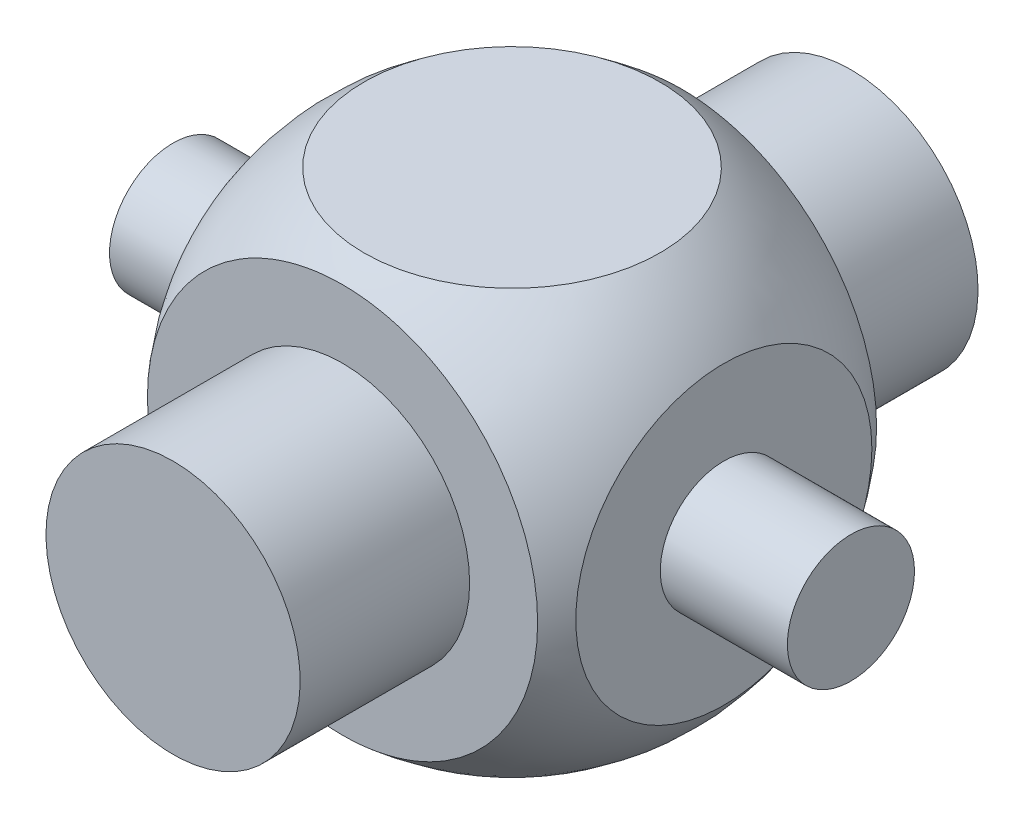
ISO-10303-21;
HEADER;
FILE_DESCRIPTION(('STEP AP214'),'2;1');
FILE_NAME('part.step','',(''),(''),'','','');
FILE_SCHEMA(('AUTOMOTIVE_DESIGN { 1 0 10303 214 1 1 1 1 }'));
ENDSEC;
DATA;
#1=APPLICATION_CONTEXT('core data for automotive mechanical design processes');
#2=APPLICATION_PROTOCOL_DEFINITION('international standard','automotive_design',2000,#1);
#3=PRODUCT_CONTEXT('',#1,'mechanical');
#4=PRODUCT('Part','Part','',(#3));
#5=PRODUCT_RELATED_PRODUCT_CATEGORY('part','',(#4));
#6=PRODUCT_DEFINITION_FORMATION('','',#4);
#7=PRODUCT_DEFINITION_CONTEXT('part definition',#1,'design');
#8=PRODUCT_DEFINITION('design','',#6,#7);
#9=PRODUCT_DEFINITION_SHAPE('','',#8);
#10=(LENGTH_UNIT() NAMED_UNIT(*) SI_UNIT(.MILLI.,.METRE.));
#11=(NAMED_UNIT(*) PLANE_ANGLE_UNIT() SI_UNIT($,.RADIAN.));
#12=(NAMED_UNIT(*) SI_UNIT($,.STERADIAN.) SOLID_ANGLE_UNIT());
#13=UNCERTAINTY_MEASURE_WITH_UNIT(LENGTH_MEASURE(1.E-05),#10,'distance_accuracy_value','');
#14=(GEOMETRIC_REPRESENTATION_CONTEXT(3) GLOBAL_UNCERTAINTY_ASSIGNED_CONTEXT((#13)) GLOBAL_UNIT_ASSIGNED_CONTEXT((#10,
#11,#12)) REPRESENTATION_CONTEXT('',''));
#15=CARTESIAN_POINT('',(0.,0.,0.));
#16=DIRECTION('',(0.,0.,1.));
#17=DIRECTION('',(1.,0.,0.));
#18=AXIS2_PLACEMENT_3D('',#15,#16,#17);
#19=CARTESIAN_POINT('',(0.,3.05,0.));
#20=DIRECTION('',(0.,-1.,0.));
#21=DIRECTION('',(0.,0.,1.));
#22=AXIS2_PLACEMENT_3D('',#19,#20,#21);
#23=SPHERICAL_SURFACE('',#22,3.05);
#24=CARTESIAN_POINT('',(-2.5,3.05,0.));
#25=DIRECTION('',(-1.,0.,0.));
#26=DIRECTION('',(0.,0.,1.));
#27=AXIS2_PLACEMENT_3D('',#24,#25,#26);
#28=CIRCLE('',#27,1.74714052096562);
#29=CARTESIAN_POINT('',(-2.5,3.05,1.74714052096562));
#30=VERTEX_POINT('',#29);
#31=EDGE_CURVE('E72',#30,#30,#28,.F.);
#32=ORIENTED_EDGE('',*,*,#31,.T.);
#33=EDGE_LOOP('',(#32));
#34=FACE_BOUND('',#33,.T.);
#35=CARTESIAN_POINT('',(0.,0.549999999999999,0.));
#36=DIRECTION('',(0.,-1.,0.));
#37=DIRECTION('',(0.,0.,-1.));
#38=AXIS2_PLACEMENT_3D('',#35,#36,#37);
#39=CIRCLE('',#38,1.74714052096561);
#40=CARTESIAN_POINT('',(0.,0.549999999999999,-1.74714052096561));
#41=VERTEX_POINT('',#40);
#42=EDGE_CURVE('E64',#41,#41,#39,.F.);
#43=ORIENTED_EDGE('',*,*,#42,.T.);
#44=EDGE_LOOP('',(#43));
#45=FACE_BOUND('',#44,.T.);
#46=CARTESIAN_POINT('',(0.,5.55,0.));
#47=DIRECTION('',(0.,1.,0.));
#48=DIRECTION('',(0.,0.,1.));
#49=AXIS2_PLACEMENT_3D('',#46,#47,#48);
#50=CIRCLE('',#49,1.74714052096562);
#51=CARTESIAN_POINT('',(0.,5.55,1.74714052096562));
#52=VERTEX_POINT('',#51);
#53=EDGE_CURVE('E71',#52,#52,#50,.F.);
#54=ORIENTED_EDGE('',*,*,#53,.T.);
#55=EDGE_LOOP('',(#54));
#56=FACE_BOUND('',#55,.T.);
#57=CARTESIAN_POINT('',(0.,3.05,2.));
#58=DIRECTION('',(0.,0.,1.));
#59=DIRECTION('',(0.,-1.,0.));
#60=AXIS2_PLACEMENT_3D('',#57,#58,#59);
#61=CIRCLE('',#60,2.30271578793389);
#62=CARTESIAN_POINT('',(0.,0.74728421206611,2.));
#63=VERTEX_POINT('',#62);
#64=EDGE_CURVE('E80',#63,#63,#61,.F.);
#65=ORIENTED_EDGE('',*,*,#64,.T.);
#66=EDGE_LOOP('',(#65));
#67=FACE_BOUND('',#66,.T.);
#68=CARTESIAN_POINT('',(0.,3.05,-2.));
#69=DIRECTION('',(0.,0.,-1.));
#70=DIRECTION('',(-1.,0.,0.));
#71=AXIS2_PLACEMENT_3D('',#68,#69,#70);
#72=CIRCLE('',#71,2.30271578793389);
#73=CARTESIAN_POINT('',(-2.30271578793389,3.05,-2.));
#74=VERTEX_POINT('',#73);
#75=EDGE_CURVE('E59',#74,#74,#72,.F.);
#76=ORIENTED_EDGE('',*,*,#75,.T.);
#77=EDGE_LOOP('',(#76));
#78=FACE_BOUND('',#77,.T.);
#79=CARTESIAN_POINT('',(2.5,3.05,0.));
#80=DIRECTION('',(1.,0.,0.));
#81=DIRECTION('',(0.,0.,-1.));
#82=AXIS2_PLACEMENT_3D('',#79,#80,#81);
#83=CIRCLE('',#82,1.74714052096561);
#84=CARTESIAN_POINT('',(2.5,3.05,-1.74714052096561));
#85=VERTEX_POINT('',#84);
#86=EDGE_CURVE('E67',#85,#85,#83,.F.);
#87=ORIENTED_EDGE('',*,*,#86,.T.);
#88=EDGE_LOOP('',(#87));
#89=FACE_BOUND('',#88,.T.);
#90=ADVANCED_FACE('F47',(#34,#45,#56,#67,#78,#89),#23,.T.);
#91=CARTESIAN_POINT('',(-3.05,5.55,2.));
#92=DIRECTION('',(0.,1.,0.));
#93=DIRECTION('',(0.,0.,1.));
#94=AXIS2_PLACEMENT_3D('',#91,#92,#93);
#95=PLANE('',#94);
#96=ORIENTED_EDGE('',*,*,#53,.F.);
#97=EDGE_LOOP('',(#96));
#98=FACE_BOUND('',#97,.T.);
#99=ADVANCED_FACE('F122',(#98),#95,.T.);
#100=CARTESIAN_POINT('',(-3.05,5.55,2.));
#101=DIRECTION('',(0.,0.,1.));
#102=DIRECTION('',(0.,-1.,0.));
#103=AXIS2_PLACEMENT_3D('',#100,#101,#102);
#104=PLANE('',#103);
#105=CARTESIAN_POINT('',(0.,3.05,2.));
#106=DIRECTION('',(0.,0.,1.));
#107=DIRECTION('',(0.,-1.,0.));
#108=AXIS2_PLACEMENT_3D('',#105,#106,#107);
#109=CIRCLE('',#108,1.5);
#110=CARTESIAN_POINT('',(0.,1.55,2.));
#111=VERTEX_POINT('',#110);
#112=EDGE_CURVE('E11',#111,#111,#109,.T.);
#113=ORIENTED_EDGE('',*,*,#112,.F.);
#114=EDGE_LOOP('',(#113));
#115=FACE_BOUND('',#114,.T.);
#116=ORIENTED_EDGE('',*,*,#64,.F.);
#117=EDGE_LOOP('',(#116));
#118=FACE_BOUND('',#117,.T.);
#119=ADVANCED_FACE('F129',(#115,#118),#104,.T.);
#120=CARTESIAN_POINT('',(-3.05,0.549999999999999,2.));
#121=DIRECTION('',(0.,-1.,0.));
#122=DIRECTION('',(0.,0.,-1.));
#123=AXIS2_PLACEMENT_3D('',#120,#121,#122);
#124=PLANE('',#123);
#125=ORIENTED_EDGE('',*,*,#42,.F.);
#126=EDGE_LOOP('',(#125));
#127=FACE_BOUND('',#126,.T.);
#128=ADVANCED_FACE('F161',(#127),#124,.T.);
#129=CARTESIAN_POINT('',(-3.05,5.55,-2.));
#130=DIRECTION('',(0.,0.,-1.));
#131=DIRECTION('',(-1.,0.,0.));
#132=AXIS2_PLACEMENT_3D('',#129,#130,#131);
#133=PLANE('',#132);
#134=CARTESIAN_POINT('',(0.,3.05,-2.));
#135=DIRECTION('',(0.,0.,-1.));
#136=DIRECTION('',(0.,1.,0.));
#137=AXIS2_PLACEMENT_3D('',#134,#135,#136);
#138=CIRCLE('',#137,1.5);
#139=CARTESIAN_POINT('',(0.,4.55,-2.));
#140=VERTEX_POINT('',#139);
#141=EDGE_CURVE('E99',#140,#140,#138,.T.);
#142=ORIENTED_EDGE('',*,*,#141,.F.);
#143=EDGE_LOOP('',(#142));
#144=FACE_BOUND('',#143,.T.);
#145=ORIENTED_EDGE('',*,*,#75,.F.);
#146=EDGE_LOOP('',(#145));
#147=FACE_BOUND('',#146,.T.);
#148=ADVANCED_FACE('F156',(#144,#147),#133,.T.);
#149=CARTESIAN_POINT('',(-2.5,0.55,-2.));
#150=DIRECTION('',(-1.,0.,0.));
#151=DIRECTION('',(0.,0.,1.));
#152=AXIS2_PLACEMENT_3D('',#149,#150,#151);
#153=PLANE('',#152);
#154=CARTESIAN_POINT('',(-2.5,3.05,0.));
#155=DIRECTION('',(-1.,0.,0.));
#156=DIRECTION('',(0.,0.,1.));
#157=AXIS2_PLACEMENT_3D('',#154,#155,#156);
#158=CIRCLE('',#157,0.75);
#159=CARTESIAN_POINT('',(-2.5,3.05,0.75));
#160=VERTEX_POINT('',#159);
#161=EDGE_CURVE('E54',#160,#160,#158,.T.);
#162=ORIENTED_EDGE('',*,*,#161,.F.);
#163=EDGE_LOOP('',(#162));
#164=FACE_BOUND('',#163,.T.);
#165=ORIENTED_EDGE('',*,*,#31,.F.);
#166=EDGE_LOOP('',(#165));
#167=FACE_BOUND('',#166,.T.);
#168=ADVANCED_FACE('F146',(#164,#167),#153,.T.);
#169=CARTESIAN_POINT('',(2.5,0.55,-2.));
#170=DIRECTION('',(1.,0.,0.));
#171=DIRECTION('',(0.,0.,-1.));
#172=AXIS2_PLACEMENT_3D('',#169,#170,#171);
#173=PLANE('',#172);
#174=CARTESIAN_POINT('',(2.5,3.05,0.));
#175=DIRECTION('',(1.,0.,0.));
#176=DIRECTION('',(0.,0.,-1.));
#177=AXIS2_PLACEMENT_3D('',#174,#175,#176);
#178=CIRCLE('',#177,0.75);
#179=CARTESIAN_POINT('',(2.5,3.05,-0.75));
#180=VERTEX_POINT('',#179);
#181=EDGE_CURVE('E87',#180,#180,#178,.T.);
#182=ORIENTED_EDGE('',*,*,#181,.F.);
#183=EDGE_LOOP('',(#182));
#184=FACE_BOUND('',#183,.T.);
#185=ORIENTED_EDGE('',*,*,#86,.F.);
#186=EDGE_LOOP('',(#185));
#187=FACE_BOUND('',#186,.T.);
#188=ADVANCED_FACE('F144',(#184,#187),#173,.T.);
#189=CARTESIAN_POINT('',(4.,3.05,0.));
#190=DIRECTION('',(-1.,0.,0.));
#191=DIRECTION('',(0.,0.,1.));
#192=AXIS2_PLACEMENT_3D('',#189,#190,#191);
#193=CYLINDRICAL_SURFACE('',#192,0.75);
#194=CARTESIAN_POINT('',(4.,3.05,0.));
#195=DIRECTION('',(1.,0.,0.));
#196=DIRECTION('',(0.,0.,-1.));
#197=AXIS2_PLACEMENT_3D('',#194,#195,#196);
#198=CIRCLE('',#197,0.75);
#199=CARTESIAN_POINT('',(4.,3.05,-0.75));
#200=VERTEX_POINT('',#199);
#201=EDGE_CURVE('E75',#200,#200,#198,.T.);
#202=ORIENTED_EDGE('',*,*,#201,.F.);
#203=EDGE_LOOP('',(#202));
#204=FACE_BOUND('',#203,.T.);
#205=ORIENTED_EDGE('',*,*,#181,.T.);
#206=EDGE_LOOP('',(#205));
#207=FACE_BOUND('',#206,.T.);
#208=ADVANCED_FACE('F145',(#204,#207),#193,.T.);
#209=CARTESIAN_POINT('',(4.,3.05,0.));
#210=DIRECTION('',(1.,0.,0.));
#211=DIRECTION('',(0.,0.,-1.));
#212=AXIS2_PLACEMENT_3D('',#209,#210,#211);
#213=PLANE('',#212);
#214=ORIENTED_EDGE('',*,*,#201,.T.);
#215=EDGE_LOOP('',(#214));
#216=FACE_BOUND('',#215,.T.);
#217=ADVANCED_FACE('F152',(#216),#213,.T.);
#218=CARTESIAN_POINT('',(-4.,3.05,0.));
#219=DIRECTION('',(1.,0.,0.));
#220=DIRECTION('',(0.,0.,-1.));
#221=AXIS2_PLACEMENT_3D('',#218,#219,#220);
#222=CYLINDRICAL_SURFACE('',#221,0.75);
#223=CARTESIAN_POINT('',(-4.,3.05,0.));
#224=DIRECTION('',(1.,0.,0.));
#225=DIRECTION('',(0.,0.,-1.));
#226=AXIS2_PLACEMENT_3D('',#223,#224,#225);
#227=CIRCLE('',#226,0.75);
#228=CARTESIAN_POINT('',(-4.,3.05,-0.75));
#229=VERTEX_POINT('',#228);
#230=EDGE_CURVE('E91',#229,#229,#227,.T.);
#231=ORIENTED_EDGE('',*,*,#230,.T.);
#232=EDGE_LOOP('',(#231));
#233=FACE_BOUND('',#232,.T.);
#234=ORIENTED_EDGE('',*,*,#161,.T.);
#235=EDGE_LOOP('',(#234));
#236=FACE_BOUND('',#235,.T.);
#237=ADVANCED_FACE('F184',(#233,#236),#222,.T.);
#238=CARTESIAN_POINT('',(-4.,3.05,0.));
#239=DIRECTION('',(-1.,0.,0.));
#240=DIRECTION('',(0.,0.,-1.));
#241=AXIS2_PLACEMENT_3D('',#238,#239,#240);
#242=PLANE('',#241);
#243=ORIENTED_EDGE('',*,*,#230,.F.);
#244=EDGE_LOOP('',(#243));
#245=FACE_BOUND('',#244,.T.);
#246=ADVANCED_FACE('F176',(#245),#242,.T.);
#247=CARTESIAN_POINT('',(0.,3.05,-4.));
#248=DIRECTION('',(0.,0.,1.));
#249=DIRECTION('',(0.,-1.,0.));
#250=AXIS2_PLACEMENT_3D('',#247,#248,#249);
#251=CYLINDRICAL_SURFACE('',#250,1.5);
#252=CARTESIAN_POINT('',(0.,3.05,-4.));
#253=DIRECTION('',(0.,0.,-1.));
#254=DIRECTION('',(0.,1.,0.));
#255=AXIS2_PLACEMENT_3D('',#252,#253,#254);
#256=CIRCLE('',#255,1.5);
#257=CARTESIAN_POINT('',(0.,4.55,-4.));
#258=VERTEX_POINT('',#257);
#259=EDGE_CURVE('E98',#258,#258,#256,.T.);
#260=ORIENTED_EDGE('',*,*,#259,.F.);
#261=EDGE_LOOP('',(#260));
#262=FACE_BOUND('',#261,.T.);
#263=ORIENTED_EDGE('',*,*,#141,.T.);
#264=EDGE_LOOP('',(#263));
#265=FACE_BOUND('',#264,.T.);
#266=ADVANCED_FACE('F175',(#262,#265),#251,.T.);
#267=CARTESIAN_POINT('',(0.,3.05,-4.));
#268=DIRECTION('',(0.,0.,-1.));
#269=DIRECTION('',(0.,1.,0.));
#270=AXIS2_PLACEMENT_3D('',#267,#268,#269);
#271=PLANE('',#270);
#272=ORIENTED_EDGE('',*,*,#259,.T.);
#273=EDGE_LOOP('',(#272));
#274=FACE_BOUND('',#273,.T.);
#275=ADVANCED_FACE('F119',(#274),#271,.T.);
#276=CARTESIAN_POINT('',(0.,3.05,4.));
#277=DIRECTION('',(0.,0.,-1.));
#278=DIRECTION('',(0.,1.,0.));
#279=AXIS2_PLACEMENT_3D('',#276,#277,#278);
#280=CYLINDRICAL_SURFACE('',#279,1.5);
#281=CARTESIAN_POINT('',(0.,3.05,4.));
#282=DIRECTION('',(0.,0.,-1.));
#283=DIRECTION('',(0.,1.,0.));
#284=AXIS2_PLACEMENT_3D('',#281,#282,#283);
#285=CIRCLE('',#284,1.5);
#286=CARTESIAN_POINT('',(0.,4.55,4.));
#287=VERTEX_POINT('',#286);
#288=EDGE_CURVE('E103',#287,#287,#285,.T.);
#289=ORIENTED_EDGE('',*,*,#288,.T.);
#290=EDGE_LOOP('',(#289));
#291=FACE_BOUND('',#290,.T.);
#292=ORIENTED_EDGE('',*,*,#112,.T.);
#293=EDGE_LOOP('',(#292));
#294=FACE_BOUND('',#293,.T.);
#295=ADVANCED_FACE('F111',(#291,#294),#280,.T.);
#296=CARTESIAN_POINT('',(0.,3.05,4.));
#297=DIRECTION('',(0.,0.,1.));
#298=DIRECTION('',(0.,1.,0.));
#299=AXIS2_PLACEMENT_3D('',#296,#297,#298);
#300=PLANE('',#299);
#301=ORIENTED_EDGE('',*,*,#288,.F.);
#302=EDGE_LOOP('',(#301));
#303=FACE_BOUND('',#302,.T.);
#304=ADVANCED_FACE('F113',(#303),#300,.T.);
#305=CLOSED_SHELL('',(#90,#99,#119,#128,#148,#168,#188,#208,#217,#237,#246,#266,#275,#295,#304));
#306=MANIFOLD_SOLID_BREP('B2',#305);
#307=ADVANCED_BREP_SHAPE_REPRESENTATION('',(#18,#306),#14);
#308=SHAPE_DEFINITION_REPRESENTATION(#9,#307);
ENDSEC;
END-ISO-10303-21;
